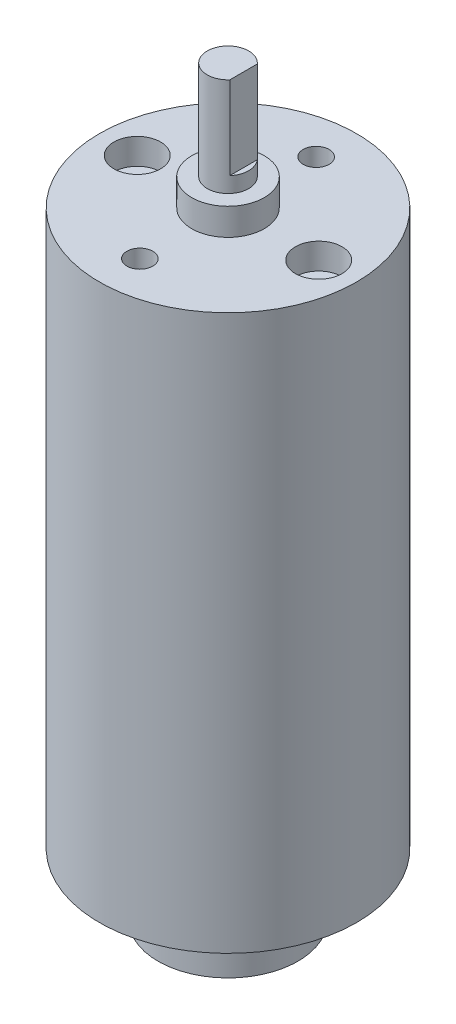
ISO-10303-21;
HEADER;
FILE_DESCRIPTION(('STEP AP214'),'2;1');
FILE_NAME('part.step','',(''),(''),'','','');
FILE_SCHEMA(('AUTOMOTIVE_DESIGN { 1 0 10303 214 1 1 1 1 }'));
ENDSEC;
DATA;
#1=APPLICATION_CONTEXT('core data for automotive mechanical design processes');
#2=APPLICATION_PROTOCOL_DEFINITION('international standard','automotive_design',2000,#1);
#3=PRODUCT_CONTEXT('',#1,'mechanical');
#4=PRODUCT('Part','Part','',(#3));
#5=PRODUCT_RELATED_PRODUCT_CATEGORY('part','',(#4));
#6=PRODUCT_DEFINITION_FORMATION('','',#4);
#7=PRODUCT_DEFINITION_CONTEXT('part definition',#1,'design');
#8=PRODUCT_DEFINITION('design','',#6,#7);
#9=PRODUCT_DEFINITION_SHAPE('','',#8);
#10=(LENGTH_UNIT() NAMED_UNIT(*) SI_UNIT(.MILLI.,.METRE.));
#11=(NAMED_UNIT(*) PLANE_ANGLE_UNIT() SI_UNIT($,.RADIAN.));
#12=(NAMED_UNIT(*) SI_UNIT($,.STERADIAN.) SOLID_ANGLE_UNIT());
#13=UNCERTAINTY_MEASURE_WITH_UNIT(LENGTH_MEASURE(1.E-05),#10,'distance_accuracy_value','');
#14=(GEOMETRIC_REPRESENTATION_CONTEXT(3) GLOBAL_UNCERTAINTY_ASSIGNED_CONTEXT((#13)) GLOBAL_UNIT_ASSIGNED_CONTEXT((#10,
#11,#12)) REPRESENTATION_CONTEXT('',''));
#15=CARTESIAN_POINT('',(0.,0.,0.));
#16=DIRECTION('',(0.,0.,1.));
#17=DIRECTION('',(1.,0.,0.));
#18=AXIS2_PLACEMENT_3D('',#15,#16,#17);
#19=CARTESIAN_POINT('',(0.,0.,0.));
#20=DIRECTION('',(0.,1.,0.));
#21=DIRECTION('',(-1.,0.,0.));
#22=AXIS2_PLACEMENT_3D('',#19,#20,#21);
#23=PLANE('',#22);
#24=CARTESIAN_POINT('',(0.,0.,0.));
#25=DIRECTION('',(0.,1.,0.));
#26=DIRECTION('',(-1.,0.,0.));
#27=AXIS2_PLACEMENT_3D('',#24,#25,#26);
#28=CIRCLE('',#27,1.);
#29=CARTESIAN_POINT('',(-1.,0.,0.));
#30=VERTEX_POINT('',#29);
#31=EDGE_CURVE('E11',#30,#30,#28,.T.);
#32=ORIENTED_EDGE('',*,*,#31,.F.);
#33=EDGE_LOOP('',(#32));
#34=FACE_BOUND('',#33,.T.);
#35=ADVANCED_FACE('F42',(#34),#23,.F.);
#36=CARTESIAN_POINT('',(0.,73.7,0.));
#37=DIRECTION('',(0.,1.,0.));
#38=DIRECTION('',(-1.,0.,0.));
#39=AXIS2_PLACEMENT_3D('',#36,#37,#38);
#40=CYLINDRICAL_SURFACE('',#39,1.);
#41=CARTESIAN_POINT('',(0.,2.05,0.));
#42=DIRECTION('',(0.,1.,0.));
#43=DIRECTION('',(-1.,0.,0.));
#44=AXIS2_PLACEMENT_3D('',#41,#42,#43);
#45=CIRCLE('',#44,1.);
#46=CARTESIAN_POINT('',(-1.,2.05,0.));
#47=VERTEX_POINT('',#46);
#48=EDGE_CURVE('E49',#47,#47,#45,.T.);
#49=ORIENTED_EDGE('',*,*,#48,.F.);
#50=EDGE_LOOP('',(#49));
#51=FACE_BOUND('',#50,.T.);
#52=ORIENTED_EDGE('',*,*,#31,.T.);
#53=EDGE_LOOP('',(#52));
#54=FACE_BOUND('',#53,.T.);
#55=ADVANCED_FACE('F121',(#51,#54),#40,.T.);
#56=CARTESIAN_POINT('',(1.,2.05,0.));
#57=DIRECTION('',(0.,1.,0.));
#58=DIRECTION('',(-1.,0.,0.));
#59=AXIS2_PLACEMENT_3D('',#56,#57,#58);
#60=PLANE('',#59);
#61=CARTESIAN_POINT('',(0.,2.05,0.));
#62=DIRECTION('',(0.,1.,0.));
#63=DIRECTION('',(-1.,0.,0.));
#64=AXIS2_PLACEMENT_3D('',#61,#62,#63);
#65=CIRCLE('',#64,6.75);
#66=CARTESIAN_POINT('',(-6.75,2.05,0.));
#67=VERTEX_POINT('',#66);
#68=EDGE_CURVE('E114',#67,#67,#65,.T.);
#69=ORIENTED_EDGE('',*,*,#68,.F.);
#70=EDGE_LOOP('',(#69));
#71=FACE_BOUND('',#70,.T.);
#72=ORIENTED_EDGE('',*,*,#48,.T.);
#73=EDGE_LOOP('',(#72));
#74=FACE_BOUND('',#73,.T.);
#75=ADVANCED_FACE('F119',(#71,#74),#60,.F.);
#76=CARTESIAN_POINT('',(0.,73.7,0.));
#77=DIRECTION('',(0.,1.,0.));
#78=DIRECTION('',(-1.,0.,0.));
#79=AXIS2_PLACEMENT_3D('',#76,#77,#78);
#80=CYLINDRICAL_SURFACE('',#79,6.75);
#81=CARTESIAN_POINT('',(0.,6.05,0.));
#82=DIRECTION('',(0.,1.,0.));
#83=DIRECTION('',(-1.,0.,0.));
#84=AXIS2_PLACEMENT_3D('',#81,#82,#83);
#85=CIRCLE('',#84,6.75);
#86=CARTESIAN_POINT('',(-6.75,6.05,0.));
#87=VERTEX_POINT('',#86);
#88=EDGE_CURVE('E111',#87,#87,#85,.T.);
#89=ORIENTED_EDGE('',*,*,#88,.F.);
#90=EDGE_LOOP('',(#89));
#91=FACE_BOUND('',#90,.T.);
#92=ORIENTED_EDGE('',*,*,#68,.T.);
#93=EDGE_LOOP('',(#92));
#94=FACE_BOUND('',#93,.T.);
#95=ADVANCED_FACE('F139',(#91,#94),#80,.T.);
#96=CARTESIAN_POINT('',(6.75,6.05,0.));
#97=DIRECTION('',(0.,-1.,0.));
#98=DIRECTION('',(1.,0.,0.));
#99=AXIS2_PLACEMENT_3D('',#96,#97,#98);
#100=PLANE('',#99);
#101=CARTESIAN_POINT('',(0.,6.05,0.));
#102=DIRECTION('',(0.,1.,0.));
#103=DIRECTION('',(-1.,0.,0.));
#104=AXIS2_PLACEMENT_3D('',#101,#102,#103);
#105=CIRCLE('',#104,1.);
#106=CARTESIAN_POINT('',(-1.,6.05,0.));
#107=VERTEX_POINT('',#106);
#108=EDGE_CURVE('E108',#107,#107,#105,.T.);
#109=ORIENTED_EDGE('',*,*,#108,.F.);
#110=EDGE_LOOP('',(#109));
#111=FACE_BOUND('',#110,.T.);
#112=ORIENTED_EDGE('',*,*,#88,.T.);
#113=EDGE_LOOP('',(#112));
#114=FACE_BOUND('',#113,.T.);
#115=ADVANCED_FACE('F147',(#111,#114),#100,.F.);
#116=CARTESIAN_POINT('',(0.,73.7,0.));
#117=DIRECTION('',(0.,1.,0.));
#118=DIRECTION('',(-1.,0.,0.));
#119=AXIS2_PLACEMENT_3D('',#116,#117,#118);
#120=CYLINDRICAL_SURFACE('',#119,1.);
#121=CARTESIAN_POINT('',(0.,8.1,0.));
#122=DIRECTION('',(0.,1.,0.));
#123=DIRECTION('',(-1.,0.,0.));
#124=AXIS2_PLACEMENT_3D('',#121,#122,#123);
#125=CIRCLE('',#124,1.);
#126=CARTESIAN_POINT('',(-1.,8.1,0.));
#127=VERTEX_POINT('',#126);
#128=EDGE_CURVE('E105',#127,#127,#125,.T.);
#129=ORIENTED_EDGE('',*,*,#128,.F.);
#130=EDGE_LOOP('',(#129));
#131=FACE_BOUND('',#130,.T.);
#132=ORIENTED_EDGE('',*,*,#108,.T.);
#133=EDGE_LOOP('',(#132));
#134=FACE_BOUND('',#133,.T.);
#135=ADVANCED_FACE('F155',(#131,#134),#120,.T.);
#136=CARTESIAN_POINT('',(1.,8.1,0.));
#137=DIRECTION('',(0.,1.,0.));
#138=DIRECTION('',(-1.,0.,0.));
#139=AXIS2_PLACEMENT_3D('',#136,#137,#138);
#140=PLANE('',#139);
#141=CARTESIAN_POINT('',(0.,8.1,0.));
#142=DIRECTION('',(0.,1.,0.));
#143=DIRECTION('',(-1.,0.,0.));
#144=AXIS2_PLACEMENT_3D('',#141,#142,#143);
#145=CIRCLE('',#144,12.4);
#146=CARTESIAN_POINT('',(-12.4,8.09999999999999,0.));
#147=VERTEX_POINT('',#146);
#148=EDGE_CURVE('E102',#147,#147,#145,.T.);
#149=ORIENTED_EDGE('',*,*,#148,.F.);
#150=EDGE_LOOP('',(#149));
#151=FACE_BOUND('',#150,.T.);
#152=ORIENTED_EDGE('',*,*,#128,.T.);
#153=EDGE_LOOP('',(#152));
#154=FACE_BOUND('',#153,.T.);
#155=ADVANCED_FACE('F163',(#151,#154),#140,.F.);
#156=CARTESIAN_POINT('',(0.,73.7,0.));
#157=DIRECTION('',(0.,1.,0.));
#158=DIRECTION('',(-1.,0.,0.));
#159=AXIS2_PLACEMENT_3D('',#156,#157,#158);
#160=CYLINDRICAL_SURFACE('',#159,12.4);
#161=CARTESIAN_POINT('',(0.,61.6,0.));
#162=DIRECTION('',(0.,1.,0.));
#163=DIRECTION('',(-1.,0.,0.));
#164=AXIS2_PLACEMENT_3D('',#161,#162,#163);
#165=CIRCLE('',#164,12.4);
#166=CARTESIAN_POINT('',(-12.4,61.6,0.));
#167=VERTEX_POINT('',#166);
#168=EDGE_CURVE('E99',#167,#167,#165,.T.);
#169=ORIENTED_EDGE('',*,*,#168,.F.);
#170=EDGE_LOOP('',(#169));
#171=FACE_BOUND('',#170,.T.);
#172=ORIENTED_EDGE('',*,*,#148,.T.);
#173=EDGE_LOOP('',(#172));
#174=FACE_BOUND('',#173,.T.);
#175=ADVANCED_FACE('F171',(#171,#174),#160,.T.);
#176=CARTESIAN_POINT('',(12.4,61.6,0.));
#177=DIRECTION('',(0.,-1.,0.));
#178=DIRECTION('',(1.,0.,0.));
#179=AXIS2_PLACEMENT_3D('',#176,#177,#178);
#180=PLANE('',#179);
#181=CARTESIAN_POINT('',(8.75,61.6,0.));
#182=DIRECTION('',(0.,1.,0.));
#183=DIRECTION('',(-1.,0.,0.));
#184=AXIS2_PLACEMENT_3D('',#181,#182,#183);
#185=CIRCLE('',#184,2.25);
#186=CARTESIAN_POINT('',(6.5,61.6,0.));
#187=VERTEX_POINT('',#186);
#188=EDGE_CURVE('E89',#187,#187,#185,.T.);
#189=ORIENTED_EDGE('',*,*,#188,.F.);
#190=EDGE_LOOP('',(#189));
#191=FACE_BOUND('',#190,.T.);
#192=CARTESIAN_POINT('',(-8.75000000000001,61.6,0.));
#193=DIRECTION('',(0.,1.,0.));
#194=DIRECTION('',(-1.,0.,0.));
#195=AXIS2_PLACEMENT_3D('',#192,#193,#194);
#196=CIRCLE('',#195,2.25);
#197=CARTESIAN_POINT('',(-11.,61.6,0.));
#198=VERTEX_POINT('',#197);
#199=EDGE_CURVE('E349',#198,#198,#196,.T.);
#200=ORIENTED_EDGE('',*,*,#199,.F.);
#201=EDGE_LOOP('',(#200));
#202=FACE_BOUND('',#201,.T.);
#203=CARTESIAN_POINT('',(0.,61.6,8.5));
#204=DIRECTION('',(0.,1.,0.));
#205=DIRECTION('',(-1.,0.,0.));
#206=AXIS2_PLACEMENT_3D('',#203,#204,#205);
#207=CIRCLE('',#206,1.25);
#208=CARTESIAN_POINT('',(-1.25000000000007,61.6,8.5));
#209=VERTEX_POINT('',#208);
#210=EDGE_CURVE('E355',#209,#209,#207,.T.);
#211=ORIENTED_EDGE('',*,*,#210,.F.);
#212=EDGE_LOOP('',(#211));
#213=FACE_BOUND('',#212,.T.);
#214=CARTESIAN_POINT('',(0.,61.6,-8.5));
#215=DIRECTION('',(0.,1.,0.));
#216=DIRECTION('',(-1.,0.,0.));
#217=AXIS2_PLACEMENT_3D('',#214,#215,#216);
#218=CIRCLE('',#217,1.25);
#219=CARTESIAN_POINT('',(-1.25000000000001,61.6,-8.5));
#220=VERTEX_POINT('',#219);
#221=EDGE_CURVE('E360',#220,#220,#218,.T.);
#222=ORIENTED_EDGE('',*,*,#221,.F.);
#223=EDGE_LOOP('',(#222));
#224=FACE_BOUND('',#223,.T.);
#225=CARTESIAN_POINT('',(0.,61.6,0.));
#226=DIRECTION('',(0.,1.,0.));
#227=DIRECTION('',(-1.,0.,0.));
#228=AXIS2_PLACEMENT_3D('',#225,#226,#227);
#229=CIRCLE('',#228,3.5);
#230=CARTESIAN_POINT('',(-3.50000000000001,61.6,0.));
#231=VERTEX_POINT('',#230);
#232=EDGE_CURVE('E96',#231,#231,#229,.T.);
#233=ORIENTED_EDGE('',*,*,#232,.F.);
#234=EDGE_LOOP('',(#233));
#235=FACE_BOUND('',#234,.T.);
#236=ORIENTED_EDGE('',*,*,#168,.T.);
#237=EDGE_LOOP('',(#236));
#238=FACE_BOUND('',#237,.T.);
#239=ADVANCED_FACE('F179',(#191,#202,#213,#224,#235,#238),#180,.F.);
#240=CARTESIAN_POINT('',(0.,73.7,0.));
#241=DIRECTION('',(0.,1.,0.));
#242=DIRECTION('',(-1.,0.,0.));
#243=AXIS2_PLACEMENT_3D('',#240,#241,#242);
#244=CYLINDRICAL_SURFACE('',#243,3.5);
#245=CARTESIAN_POINT('',(0.,64.2,0.));
#246=DIRECTION('',(0.,1.,0.));
#247=DIRECTION('',(-1.,0.,0.));
#248=AXIS2_PLACEMENT_3D('',#245,#246,#247);
#249=CIRCLE('',#248,3.5);
#250=CARTESIAN_POINT('',(-3.50000000000001,64.2,0.));
#251=VERTEX_POINT('',#250);
#252=EDGE_CURVE('E86',#251,#251,#249,.T.);
#253=ORIENTED_EDGE('',*,*,#252,.F.);
#254=EDGE_LOOP('',(#253));
#255=FACE_BOUND('',#254,.T.);
#256=ORIENTED_EDGE('',*,*,#232,.T.);
#257=EDGE_LOOP('',(#256));
#258=FACE_BOUND('',#257,.T.);
#259=ADVANCED_FACE('F188',(#255,#258),#244,.T.);
#260=CARTESIAN_POINT('',(3.49999999999999,64.2,0.));
#261=DIRECTION('',(0.,-1.,0.));
#262=DIRECTION('',(1.,0.,0.));
#263=AXIS2_PLACEMENT_3D('',#260,#261,#262);
#264=PLANE('',#263);
#265=CARTESIAN_POINT('',(0.,64.2,0.));
#266=DIRECTION('',(0.,1.,0.));
#267=DIRECTION('',(-1.,0.,0.));
#268=AXIS2_PLACEMENT_3D('',#265,#266,#267);
#269=CIRCLE('',#268,2.);
#270=CARTESIAN_POINT('',(-2.00000000000001,64.2,0.));
#271=VERTEX_POINT('',#270);
#272=EDGE_CURVE('E82',#271,#271,#269,.T.);
#273=ORIENTED_EDGE('',*,*,#272,.F.);
#274=EDGE_LOOP('',(#273));
#275=FACE_BOUND('',#274,.T.);
#276=ORIENTED_EDGE('',*,*,#252,.T.);
#277=EDGE_LOOP('',(#276));
#278=FACE_BOUND('',#277,.T.);
#279=ADVANCED_FACE('F197',(#275,#278),#264,.F.);
#280=CARTESIAN_POINT('',(0.,73.7,0.));
#281=DIRECTION('',(0.,1.,0.));
#282=DIRECTION('',(-1.,0.,0.));
#283=AXIS2_PLACEMENT_3D('',#280,#281,#282);
#284=CYLINDRICAL_SURFACE('',#283,2.);
#285=CARTESIAN_POINT('',(0.,65.7,0.));
#286=DIRECTION('',(0.,1.,0.));
#287=DIRECTION('',(0.,0.,1.));
#288=AXIS2_PLACEMENT_3D('',#285,#286,#287);
#289=CIRCLE('',#288,2.);
#290=CARTESIAN_POINT('',(1.49999999999999,65.7,1.32287565553229));
#291=VERTEX_POINT('',#290);
#292=CARTESIAN_POINT('',(1.49999999999999,65.7,-1.3228756555323));
#293=VERTEX_POINT('',#292);
#294=EDGE_CURVE('E72',#291,#293,#289,.T.);
#295=ORIENTED_EDGE('',*,*,#294,.F.);
#296=DIRECTION('',(0.,1.,0.));
#297=VECTOR('',#296,1.);
#298=CARTESIAN_POINT('',(1.49999999999999,65.7,1.32287565553229));
#299=LINE('',#298,#297);
#300=CARTESIAN_POINT('',(1.49999999999999,73.7,1.32287565553229));
#301=VERTEX_POINT('',#300);
#302=EDGE_CURVE('E62',#291,#301,#299,.T.);
#303=ORIENTED_EDGE('',*,*,#302,.T.);
#304=CARTESIAN_POINT('',(0.,73.7,0.));
#305=DIRECTION('',(0.,1.,0.));
#306=DIRECTION('',(-1.,0.,0.));
#307=AXIS2_PLACEMENT_3D('',#304,#305,#306);
#308=CIRCLE('',#307,2.);
#309=CARTESIAN_POINT('',(1.49999999999999,73.7,-1.3228756555323));
#310=VERTEX_POINT('',#309);
#311=EDGE_CURVE('E78',#310,#301,#308,.T.);
#312=ORIENTED_EDGE('',*,*,#311,.F.);
#313=DIRECTION('',(0.,1.,0.));
#314=VECTOR('',#313,1.);
#315=CARTESIAN_POINT('',(1.49999999999999,65.7,-1.3228756555323));
#316=LINE('',#315,#314);
#317=EDGE_CURVE('E56',#293,#310,#316,.T.);
#318=ORIENTED_EDGE('',*,*,#317,.F.);
#319=EDGE_LOOP('',(#295,#303,#312,#318));
#320=FACE_BOUND('',#319,.T.);
#321=ORIENTED_EDGE('',*,*,#272,.T.);
#322=EDGE_LOOP('',(#321));
#323=FACE_BOUND('',#322,.T.);
#324=ADVANCED_FACE('F76',(#320,#323),#284,.T.);
#325=CARTESIAN_POINT('',(1.99999999999999,73.7,0.));
#326=DIRECTION('',(0.,-1.,0.));
#327=DIRECTION('',(1.,0.,0.));
#328=AXIS2_PLACEMENT_3D('',#325,#326,#327);
#329=PLANE('',#328);
#330=ORIENTED_EDGE('',*,*,#311,.T.);
#331=DIRECTION('',(0.,0.,1.));
#332=VECTOR('',#331,1.);
#333=CARTESIAN_POINT('',(1.49999999999999,73.7,0.));
#334=LINE('',#333,#332);
#335=EDGE_CURVE('E67',#310,#301,#334,.T.);
#336=ORIENTED_EDGE('',*,*,#335,.F.);
#337=EDGE_LOOP('',(#330,#336));
#338=FACE_BOUND('',#337,.T.);
#339=ADVANCED_FACE('F81',(#338),#329,.F.);
#340=CARTESIAN_POINT('',(0.,59.1,-8.5));
#341=DIRECTION('',(0.,1.,0.));
#342=DIRECTION('',(-1.,0.,0.));
#343=AXIS2_PLACEMENT_3D('',#340,#341,#342);
#344=CYLINDRICAL_SURFACE('',#343,1.25);
#345=CARTESIAN_POINT('',(0.,59.1,-8.5));
#346=DIRECTION('',(0.,1.,0.));
#347=DIRECTION('',(-1.,0.,0.));
#348=AXIS2_PLACEMENT_3D('',#345,#346,#347);
#349=CIRCLE('',#348,1.25);
#350=CARTESIAN_POINT('',(-1.25000000000001,59.1,-8.5));
#351=VERTEX_POINT('',#350);
#352=EDGE_CURVE('E79',#351,#351,#349,.T.);
#353=ORIENTED_EDGE('',*,*,#352,.F.);
#354=EDGE_LOOP('',(#353));
#355=FACE_BOUND('',#354,.T.);
#356=ORIENTED_EDGE('',*,*,#221,.T.);
#357=EDGE_LOOP('',(#356));
#358=FACE_BOUND('',#357,.T.);
#359=ADVANCED_FACE('F218',(#355,#358),#344,.F.);
#360=CARTESIAN_POINT('',(0.,59.1,-8.5));
#361=DIRECTION('',(0.,1.,0.));
#362=DIRECTION('',(-1.,0.,0.));
#363=AXIS2_PLACEMENT_3D('',#360,#361,#362);
#364=PLANE('',#363);
#365=ORIENTED_EDGE('',*,*,#352,.T.);
#366=EDGE_LOOP('',(#365));
#367=FACE_BOUND('',#366,.T.);
#368=ADVANCED_FACE('F225',(#367),#364,.T.);
#369=CARTESIAN_POINT('',(0.,59.1,8.5));
#370=DIRECTION('',(0.,1.,0.));
#371=DIRECTION('',(-1.,0.,0.));
#372=AXIS2_PLACEMENT_3D('',#369,#370,#371);
#373=CYLINDRICAL_SURFACE('',#372,1.25);
#374=CARTESIAN_POINT('',(0.,59.1,8.5));
#375=DIRECTION('',(0.,1.,0.));
#376=DIRECTION('',(-1.,0.,0.));
#377=AXIS2_PLACEMENT_3D('',#374,#375,#376);
#378=CIRCLE('',#377,1.25);
#379=CARTESIAN_POINT('',(-1.25000000000007,59.1,8.5));
#380=VERTEX_POINT('',#379);
#381=EDGE_CURVE('E358',#380,#380,#378,.T.);
#382=ORIENTED_EDGE('',*,*,#381,.F.);
#383=EDGE_LOOP('',(#382));
#384=FACE_BOUND('',#383,.T.);
#385=ORIENTED_EDGE('',*,*,#210,.T.);
#386=EDGE_LOOP('',(#385));
#387=FACE_BOUND('',#386,.T.);
#388=ADVANCED_FACE('F233',(#384,#387),#373,.F.);
#389=CARTESIAN_POINT('',(0.,59.1,8.5));
#390=DIRECTION('',(0.,1.,0.));
#391=DIRECTION('',(-1.,0.,0.));
#392=AXIS2_PLACEMENT_3D('',#389,#390,#391);
#393=PLANE('',#392);
#394=ORIENTED_EDGE('',*,*,#381,.T.);
#395=EDGE_LOOP('',(#394));
#396=FACE_BOUND('',#395,.T.);
#397=ADVANCED_FACE('F241',(#396),#393,.T.);
#398=CARTESIAN_POINT('',(-8.75000000000001,59.1,0.));
#399=DIRECTION('',(0.,1.,0.));
#400=DIRECTION('',(-1.,0.,0.));
#401=AXIS2_PLACEMENT_3D('',#398,#399,#400);
#402=CYLINDRICAL_SURFACE('',#401,2.25);
#403=CARTESIAN_POINT('',(-8.75000000000001,59.1,0.));
#404=DIRECTION('',(0.,1.,0.));
#405=DIRECTION('',(-1.,0.,0.));
#406=AXIS2_PLACEMENT_3D('',#403,#404,#405);
#407=CIRCLE('',#406,2.25);
#408=CARTESIAN_POINT('',(-11.,59.1,0.));
#409=VERTEX_POINT('',#408);
#410=EDGE_CURVE('E352',#409,#409,#407,.T.);
#411=ORIENTED_EDGE('',*,*,#410,.F.);
#412=EDGE_LOOP('',(#411));
#413=FACE_BOUND('',#412,.T.);
#414=ORIENTED_EDGE('',*,*,#199,.T.);
#415=EDGE_LOOP('',(#414));
#416=FACE_BOUND('',#415,.T.);
#417=ADVANCED_FACE('F249',(#413,#416),#402,.F.);
#418=CARTESIAN_POINT('',(-8.75000000000001,59.1,0.));
#419=DIRECTION('',(0.,1.,0.));
#420=DIRECTION('',(-1.,0.,0.));
#421=AXIS2_PLACEMENT_3D('',#418,#419,#420);
#422=PLANE('',#421);
#423=ORIENTED_EDGE('',*,*,#410,.T.);
#424=EDGE_LOOP('',(#423));
#425=FACE_BOUND('',#424,.T.);
#426=ADVANCED_FACE('F257',(#425),#422,.T.);
#427=CARTESIAN_POINT('',(8.75,59.1,0.));
#428=DIRECTION('',(0.,1.,0.));
#429=DIRECTION('',(-1.,0.,0.));
#430=AXIS2_PLACEMENT_3D('',#427,#428,#429);
#431=CYLINDRICAL_SURFACE('',#430,2.25);
#432=CARTESIAN_POINT('',(8.75,59.1,0.));
#433=DIRECTION('',(0.,1.,0.));
#434=DIRECTION('',(-1.,0.,0.));
#435=AXIS2_PLACEMENT_3D('',#432,#433,#434);
#436=CIRCLE('',#435,2.25);
#437=CARTESIAN_POINT('',(6.5,59.1,0.));
#438=VERTEX_POINT('',#437);
#439=EDGE_CURVE('E83',#438,#438,#436,.T.);
#440=ORIENTED_EDGE('',*,*,#439,.F.);
#441=EDGE_LOOP('',(#440));
#442=FACE_BOUND('',#441,.T.);
#443=ORIENTED_EDGE('',*,*,#188,.T.);
#444=EDGE_LOOP('',(#443));
#445=FACE_BOUND('',#444,.T.);
#446=ADVANCED_FACE('F265',(#442,#445),#431,.F.);
#447=CARTESIAN_POINT('',(8.75,59.1,0.));
#448=DIRECTION('',(0.,1.,0.));
#449=DIRECTION('',(-1.,0.,0.));
#450=AXIS2_PLACEMENT_3D('',#447,#448,#449);
#451=PLANE('',#450);
#452=ORIENTED_EDGE('',*,*,#439,.T.);
#453=EDGE_LOOP('',(#452));
#454=FACE_BOUND('',#453,.T.);
#455=ADVANCED_FACE('F273',(#454),#451,.T.);
#456=CARTESIAN_POINT('',(1.49999999999999,65.7,0.));
#457=DIRECTION('',(-1.,0.,0.));
#458=DIRECTION('',(0.,0.,1.));
#459=AXIS2_PLACEMENT_3D('',#456,#457,#458);
#460=PLANE('',#459);
#461=ORIENTED_EDGE('',*,*,#335,.T.);
#462=ORIENTED_EDGE('',*,*,#302,.F.);
#463=DIRECTION('',(0.,0.,1.));
#464=VECTOR('',#463,1.);
#465=CARTESIAN_POINT('',(1.49999999999999,65.7,0.));
#466=LINE('',#465,#464);
#467=EDGE_CURVE('E342',#293,#291,#466,.T.);
#468=ORIENTED_EDGE('',*,*,#467,.F.);
#469=ORIENTED_EDGE('',*,*,#317,.T.);
#470=EDGE_LOOP('',(#461,#462,#468,#469));
#471=FACE_BOUND('',#470,.T.);
#472=ADVANCED_FACE('F68',(#471),#460,.F.);
#473=CARTESIAN_POINT('',(0.,65.7,0.));
#474=DIRECTION('',(0.,1.,0.));
#475=DIRECTION('',(0.,0.,1.));
#476=AXIS2_PLACEMENT_3D('',#473,#474,#475);
#477=PLANE('',#476);
#478=ORIENTED_EDGE('',*,*,#294,.T.);
#479=ORIENTED_EDGE('',*,*,#467,.T.);
#480=EDGE_LOOP('',(#478,#479));
#481=FACE_BOUND('',#480,.T.);
#482=ADVANCED_FACE('F286',(#481),#477,.T.);
#483=CLOSED_SHELL('',(#35,#55,#75,#95,#115,#135,#155,#175,#239,#259,#279,#324,#339,#359,#368,
#388,#397,#417,#426,#446,#455,#472,#482));
#484=MANIFOLD_SOLID_BREP('B2',#483);
#485=ADVANCED_BREP_SHAPE_REPRESENTATION('',(#18,#484),#14);
#486=SHAPE_DEFINITION_REPRESENTATION(#9,#485);
ENDSEC;
END-ISO-10303-21;
